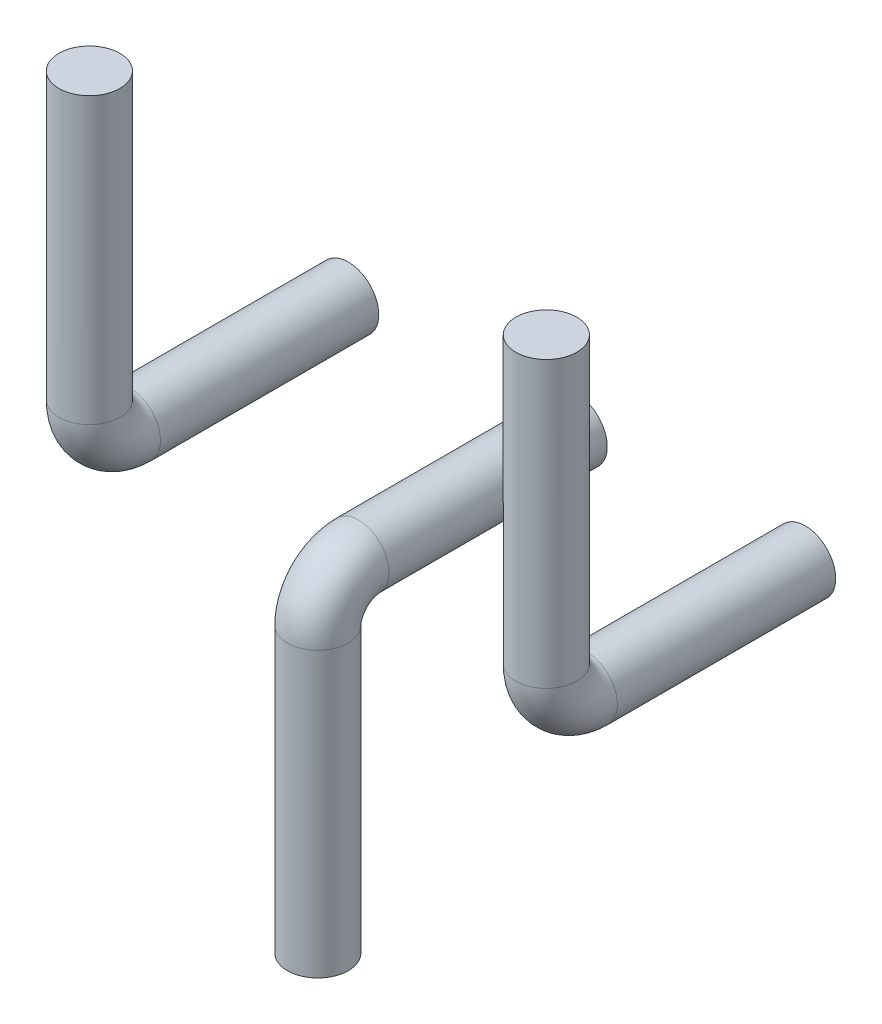
ISO-10303-21;
HEADER;
FILE_DESCRIPTION(('STEP AP214'),'2;1');
FILE_NAME('part.step','',(''),(''),'','','');
FILE_SCHEMA(('AUTOMOTIVE_DESIGN { 1 0 10303 214 1 1 1 1 }'));
ENDSEC;
DATA;
#1=APPLICATION_CONTEXT('core data for automotive mechanical design processes');
#2=APPLICATION_PROTOCOL_DEFINITION('international standard','automotive_design',2000,#1);
#3=PRODUCT_CONTEXT('',#1,'mechanical');
#4=PRODUCT('Part','Part','',(#3));
#5=PRODUCT_RELATED_PRODUCT_CATEGORY('part','',(#4));
#6=PRODUCT_DEFINITION_FORMATION('','',#4);
#7=PRODUCT_DEFINITION_CONTEXT('part definition',#1,'design');
#8=PRODUCT_DEFINITION('design','',#6,#7);
#9=PRODUCT_DEFINITION_SHAPE('','',#8);
#10=(LENGTH_UNIT() NAMED_UNIT(*) SI_UNIT(.MILLI.,.METRE.));
#11=(NAMED_UNIT(*) PLANE_ANGLE_UNIT() SI_UNIT($,.RADIAN.));
#12=(NAMED_UNIT(*) SI_UNIT($,.STERADIAN.) SOLID_ANGLE_UNIT());
#13=UNCERTAINTY_MEASURE_WITH_UNIT(LENGTH_MEASURE(1.E-05),#10,'distance_accuracy_value','');
#14=(GEOMETRIC_REPRESENTATION_CONTEXT(3) GLOBAL_UNCERTAINTY_ASSIGNED_CONTEXT((#13)) GLOBAL_UNIT_ASSIGNED_CONTEXT((#10,
#11,#12)) REPRESENTATION_CONTEXT('',''));
#15=CARTESIAN_POINT('',(0.,0.,0.));
#16=DIRECTION('',(0.,0.,1.));
#17=DIRECTION('',(1.,0.,0.));
#18=AXIS2_PLACEMENT_3D('',#15,#16,#17);
#19=CARTESIAN_POINT('',(-32.5000000000001,-32.,25.5));
#20=DIRECTION('',(0.,-1.,0.));
#21=DIRECTION('',(1.,0.,0.));
#22=AXIS2_PLACEMENT_3D('',#19,#20,#21);
#23=PLANE('',#22);
#24=CARTESIAN_POINT('',(-32.5000000000001,-32.,25.5));
#25=DIRECTION('',(0.,-1.,0.));
#26=DIRECTION('',(1.,0.,0.));
#27=AXIS2_PLACEMENT_3D('',#24,#25,#26);
#28=CIRCLE('',#27,3.);
#29=CARTESIAN_POINT('',(-29.5000000000001,-32.,25.5));
#30=VERTEX_POINT('',#29);
#31=EDGE_CURVE('E57',#30,#30,#28,.T.);
#32=ORIENTED_EDGE('',*,*,#31,.T.);
#33=EDGE_LOOP('',(#32));
#34=FACE_BOUND('',#33,.T.);
#35=ADVANCED_FACE('F43',(#34),#23,.T.);
#36=CARTESIAN_POINT('',(-32.5000000000001,-0.0508158360944468,0.));
#37=DIRECTION('',(0.,0.,1.));
#38=DIRECTION('',(1.,0.,0.));
#39=AXIS2_PLACEMENT_3D('',#36,#37,#38);
#40=PLANE('',#39);
#41=CARTESIAN_POINT('',(-32.5000000000001,-0.0508158360944468,0.));
#42=DIRECTION('',(0.,0.,1.));
#43=DIRECTION('',(1.,0.,0.));
#44=AXIS2_PLACEMENT_3D('',#41,#42,#43);
#45=CIRCLE('',#44,3.);
#46=CARTESIAN_POINT('',(-29.5000000000001,-0.0508158360944468,0.));
#47=VERTEX_POINT('',#46);
#48=EDGE_CURVE('E11',#47,#47,#45,.T.);
#49=ORIENTED_EDGE('',*,*,#48,.F.);
#50=EDGE_LOOP('',(#49));
#51=FACE_BOUND('',#50,.T.);
#52=ADVANCED_FACE('F67',(#51),#40,.F.);
#53=CARTESIAN_POINT('',(-32.5000000000001,-32.,25.5));
#54=DIRECTION('',(0.,1.,0.));
#55=DIRECTION('',(0.,0.,1.));
#56=AXIS2_PLACEMENT_3D('',#53,#54,#55);
#57=CYLINDRICAL_SURFACE('',#56,3.);
#58=CARTESIAN_POINT('',(-32.5000000000001,-4.05081583609447,25.5));
#59=DIRECTION('',(0.,-1.,0.));
#60=DIRECTION('',(1.,0.,0.));
#61=AXIS2_PLACEMENT_3D('',#58,#59,#60);
#62=CIRCLE('',#61,3.);
#63=CARTESIAN_POINT('',(-32.5000000000001,-4.0508158360945,28.5));
#64=VERTEX_POINT('',#63);
#65=EDGE_CURVE('E53',#64,#64,#62,.T.);
#66=ORIENTED_EDGE('',*,*,#65,.T.);
#67=EDGE_LOOP('',(#66));
#68=FACE_BOUND('',#67,.T.);
#69=ORIENTED_EDGE('',*,*,#31,.F.);
#70=EDGE_LOOP('',(#69));
#71=FACE_BOUND('',#70,.T.);
#72=ADVANCED_FACE('F64',(#68,#71),#57,.T.);
#73=CARTESIAN_POINT('',(-32.5000000000001,-4.05081583609445,21.5));
#74=DIRECTION('',(-1.,0.,0.));
#75=DIRECTION('',(0.,0.,1.));
#76=AXIS2_PLACEMENT_3D('',#73,#74,#75);
#77=TOROIDAL_SURFACE('',#76,4.,3.);
#78=CARTESIAN_POINT('',(-32.5000000000001,-0.0508158360944463,21.5));
#79=DIRECTION('',(0.,0.,1.));
#80=DIRECTION('',(1.,0.,0.));
#81=AXIS2_PLACEMENT_3D('',#78,#79,#80);
#82=CIRCLE('',#81,3.);
#83=CARTESIAN_POINT('',(-32.5000000000001,2.94918416390555,21.5));
#84=VERTEX_POINT('',#83);
#85=EDGE_CURVE('E49',#84,#84,#82,.T.);
#86=CARTESIAN_POINT('',(-32.5000000000001,-4.05081583609445,21.5));
#87=DIRECTION('',(-1.,0.,0.));
#88=DIRECTION('',(0.,0.,1.));
#89=AXIS2_PLACEMENT_3D('',#86,#87,#88);
#90=CIRCLE('',#89,7.);
#91=EDGE_CURVE('',#64,#84,#90,.T.);
#92=ORIENTED_EDGE('',*,*,#65,.F.);
#93=ORIENTED_EDGE('',*,*,#85,.T.);
#94=ORIENTED_EDGE('',*,*,#91,.T.);
#95=ORIENTED_EDGE('',*,*,#91,.F.);
#96=EDGE_LOOP('',(#92,#94,#93,#95));
#97=FACE_BOUND('',#96,.T.);
#98=ADVANCED_FACE('F66',(#97),#77,.T.);
#99=CARTESIAN_POINT('',(-32.5000000000001,-0.0508158360944468,21.5));
#100=DIRECTION('',(0.,0.,-1.));
#101=DIRECTION('',(-1.,0.,0.));
#102=AXIS2_PLACEMENT_3D('',#99,#100,#101);
#103=CYLINDRICAL_SURFACE('',#102,3.);
#104=ORIENTED_EDGE('',*,*,#48,.T.);
#105=EDGE_LOOP('',(#104));
#106=FACE_BOUND('',#105,.T.);
#107=ORIENTED_EDGE('',*,*,#85,.F.);
#108=EDGE_LOOP('',(#107));
#109=FACE_BOUND('',#108,.T.);
#110=ADVANCED_FACE('F74',(#106,#109),#103,.T.);
#111=CLOSED_SHELL('',(#35,#52,#72,#98,#110));
#112=MANIFOLD_SOLID_BREP('B2',#111);
#113=CARTESIAN_POINT('',(-55.0000000000002,31.9999999999999,25.5));
#114=DIRECTION('',(0.,1.,0.));
#115=DIRECTION('',(1.,0.,0.));
#116=AXIS2_PLACEMENT_3D('',#113,#114,#115);
#117=PLANE('',#116);
#118=CARTESIAN_POINT('',(-55.0000000000002,31.9999999999999,25.5));
#119=DIRECTION('',(0.,1.,0.));
#120=DIRECTION('',(1.,0.,0.));
#121=AXIS2_PLACEMENT_3D('',#118,#119,#120);
#122=CIRCLE('',#121,3.);
#123=CARTESIAN_POINT('',(-52.0000000000002,31.9999999999999,25.5));
#124=VERTEX_POINT('',#123);
#125=EDGE_CURVE('E134',#124,#124,#122,.T.);
#126=ORIENTED_EDGE('',*,*,#125,.T.);
#127=EDGE_LOOP('',(#126));
#128=FACE_BOUND('',#127,.T.);
#129=ADVANCED_FACE('F120',(#128),#117,.T.);
#130=CARTESIAN_POINT('',(-55.0000000000002,-0.0508158360944468,0.));
#131=DIRECTION('',(0.,0.,1.));
#132=DIRECTION('',(1.,0.,0.));
#133=AXIS2_PLACEMENT_3D('',#130,#131,#132);
#134=PLANE('',#133);
#135=CARTESIAN_POINT('',(-55.0000000000002,-0.0508158360944468,0.));
#136=DIRECTION('',(0.,0.,1.));
#137=DIRECTION('',(1.,0.,0.));
#138=AXIS2_PLACEMENT_3D('',#135,#136,#137);
#139=CIRCLE('',#138,3.);
#140=CARTESIAN_POINT('',(-52.0000000000002,-0.0508158360944468,0.));
#141=VERTEX_POINT('',#140);
#142=EDGE_CURVE('E42',#141,#141,#139,.T.);
#143=ORIENTED_EDGE('',*,*,#142,.F.);
#144=EDGE_LOOP('',(#143));
#145=FACE_BOUND('',#144,.T.);
#146=ADVANCED_FACE('F144',(#145),#134,.F.);
#147=CARTESIAN_POINT('',(-55.0000000000002,31.9999999999999,25.5));
#148=DIRECTION('',(0.,-1.,0.));
#149=DIRECTION('',(0.,0.,-1.));
#150=AXIS2_PLACEMENT_3D('',#147,#148,#149);
#151=CYLINDRICAL_SURFACE('',#150,3.);
#152=CARTESIAN_POINT('',(-55.0000000000002,3.94918416390558,25.5));
#153=DIRECTION('',(0.,1.,0.));
#154=DIRECTION('',(1.,0.,0.));
#155=AXIS2_PLACEMENT_3D('',#152,#153,#154);
#156=CIRCLE('',#155,3.);
#157=CARTESIAN_POINT('',(-55.0000000000002,3.9491841639056,28.5));
#158=VERTEX_POINT('',#157);
#159=EDGE_CURVE('E130',#158,#158,#156,.T.);
#160=ORIENTED_EDGE('',*,*,#159,.T.);
#161=EDGE_LOOP('',(#160));
#162=FACE_BOUND('',#161,.T.);
#163=ORIENTED_EDGE('',*,*,#125,.F.);
#164=EDGE_LOOP('',(#163));
#165=FACE_BOUND('',#164,.T.);
#166=ADVANCED_FACE('F141',(#162,#165),#151,.T.);
#167=CARTESIAN_POINT('',(-55.0000000000002,3.94918416390555,21.5));
#168=DIRECTION('',(1.,0.,0.));
#169=DIRECTION('',(0.,0.,-1.));
#170=AXIS2_PLACEMENT_3D('',#167,#168,#169);
#171=TOROIDAL_SURFACE('',#170,4.,3.);
#172=CARTESIAN_POINT('',(-55.0000000000002,-0.0508158360944472,21.5));
#173=DIRECTION('',(0.,0.,1.));
#174=DIRECTION('',(1.,0.,0.));
#175=AXIS2_PLACEMENT_3D('',#172,#173,#174);
#176=CIRCLE('',#175,3.);
#177=CARTESIAN_POINT('',(-55.0000000000002,-3.05081583609445,21.5));
#178=VERTEX_POINT('',#177);
#179=EDGE_CURVE('E126',#178,#178,#176,.T.);
#180=CARTESIAN_POINT('',(-55.0000000000002,3.94918416390555,21.5));
#181=DIRECTION('',(1.,0.,0.));
#182=DIRECTION('',(0.,0.,-1.));
#183=AXIS2_PLACEMENT_3D('',#180,#181,#182);
#184=CIRCLE('',#183,7.);
#185=EDGE_CURVE('',#158,#178,#184,.T.);
#186=ORIENTED_EDGE('',*,*,#159,.F.);
#187=ORIENTED_EDGE('',*,*,#179,.T.);
#188=ORIENTED_EDGE('',*,*,#185,.T.);
#189=ORIENTED_EDGE('',*,*,#185,.F.);
#190=EDGE_LOOP('',(#186,#188,#187,#189));
#191=FACE_BOUND('',#190,.T.);
#192=ADVANCED_FACE('F143',(#191),#171,.T.);
#193=CARTESIAN_POINT('',(-55.0000000000002,-0.0508158360944468,21.5));
#194=DIRECTION('',(0.,0.,-1.));
#195=DIRECTION('',(-1.,0.,0.));
#196=AXIS2_PLACEMENT_3D('',#193,#194,#195);
#197=CYLINDRICAL_SURFACE('',#196,3.);
#198=ORIENTED_EDGE('',*,*,#142,.T.);
#199=EDGE_LOOP('',(#198));
#200=FACE_BOUND('',#199,.T.);
#201=ORIENTED_EDGE('',*,*,#179,.F.);
#202=EDGE_LOOP('',(#201));
#203=FACE_BOUND('',#202,.T.);
#204=ADVANCED_FACE('F151',(#200,#203),#197,.T.);
#205=CLOSED_SHELL('',(#129,#146,#166,#192,#204));
#206=MANIFOLD_SOLID_BREP('B6',#205);
#207=CARTESIAN_POINT('',(-10.0000000000002,31.9999999999999,25.5));
#208=DIRECTION('',(0.,1.,0.));
#209=DIRECTION('',(1.,0.,0.));
#210=AXIS2_PLACEMENT_3D('',#207,#208,#209);
#211=PLANE('',#210);
#212=CARTESIAN_POINT('',(-10.0000000000002,31.9999999999999,25.5));
#213=DIRECTION('',(0.,1.,0.));
#214=DIRECTION('',(1.,0.,0.));
#215=AXIS2_PLACEMENT_3D('',#212,#213,#214);
#216=CIRCLE('',#215,3.);
#217=CARTESIAN_POINT('',(-7.00000000000018,31.9999999999999,25.5));
#218=VERTEX_POINT('',#217);
#219=EDGE_CURVE('E204',#218,#218,#216,.T.);
#220=ORIENTED_EDGE('',*,*,#219,.T.);
#221=EDGE_LOOP('',(#220));
#222=FACE_BOUND('',#221,.T.);
#223=ADVANCED_FACE('F190',(#222),#211,.T.);
#224=CARTESIAN_POINT('',(-10.0000000000002,-0.0508158360944468,0.));
#225=DIRECTION('',(0.,0.,1.));
#226=DIRECTION('',(1.,0.,0.));
#227=AXIS2_PLACEMENT_3D('',#224,#225,#226);
#228=PLANE('',#227);
#229=CARTESIAN_POINT('',(-10.0000000000002,-0.0508158360944468,0.));
#230=DIRECTION('',(0.,0.,1.));
#231=DIRECTION('',(1.,0.,0.));
#232=AXIS2_PLACEMENT_3D('',#229,#230,#231);
#233=CIRCLE('',#232,3.);
#234=CARTESIAN_POINT('',(-7.00000000000018,-0.0508158360944468,0.));
#235=VERTEX_POINT('',#234);
#236=EDGE_CURVE('E119',#235,#235,#233,.T.);
#237=ORIENTED_EDGE('',*,*,#236,.F.);
#238=EDGE_LOOP('',(#237));
#239=FACE_BOUND('',#238,.T.);
#240=ADVANCED_FACE('F214',(#239),#228,.F.);
#241=CARTESIAN_POINT('',(-10.0000000000002,31.9999999999999,25.5));
#242=DIRECTION('',(0.,-1.,0.));
#243=DIRECTION('',(0.,0.,-1.));
#244=AXIS2_PLACEMENT_3D('',#241,#242,#243);
#245=CYLINDRICAL_SURFACE('',#244,3.);
#246=CARTESIAN_POINT('',(-10.0000000000002,3.94918416390558,25.5));
#247=DIRECTION('',(0.,1.,0.));
#248=DIRECTION('',(1.,0.,0.));
#249=AXIS2_PLACEMENT_3D('',#246,#247,#248);
#250=CIRCLE('',#249,3.);
#251=CARTESIAN_POINT('',(-10.0000000000002,3.9491841639056,28.5));
#252=VERTEX_POINT('',#251);
#253=EDGE_CURVE('E200',#252,#252,#250,.T.);
#254=ORIENTED_EDGE('',*,*,#253,.T.);
#255=EDGE_LOOP('',(#254));
#256=FACE_BOUND('',#255,.T.);
#257=ORIENTED_EDGE('',*,*,#219,.F.);
#258=EDGE_LOOP('',(#257));
#259=FACE_BOUND('',#258,.T.);
#260=ADVANCED_FACE('F211',(#256,#259),#245,.T.);
#261=CARTESIAN_POINT('',(-10.0000000000002,3.94918416390555,21.5));
#262=DIRECTION('',(1.,0.,0.));
#263=DIRECTION('',(0.,0.,-1.));
#264=AXIS2_PLACEMENT_3D('',#261,#262,#263);
#265=TOROIDAL_SURFACE('',#264,4.,3.);
#266=CARTESIAN_POINT('',(-10.0000000000002,-0.0508158360944472,21.5));
#267=DIRECTION('',(0.,0.,1.));
#268=DIRECTION('',(1.,0.,0.));
#269=AXIS2_PLACEMENT_3D('',#266,#267,#268);
#270=CIRCLE('',#269,3.);
#271=CARTESIAN_POINT('',(-10.0000000000002,-3.05081583609445,21.5));
#272=VERTEX_POINT('',#271);
#273=EDGE_CURVE('E196',#272,#272,#270,.T.);
#274=CARTESIAN_POINT('',(-10.0000000000002,3.94918416390555,21.5));
#275=DIRECTION('',(1.,0.,0.));
#276=DIRECTION('',(0.,0.,-1.));
#277=AXIS2_PLACEMENT_3D('',#274,#275,#276);
#278=CIRCLE('',#277,7.);
#279=EDGE_CURVE('',#252,#272,#278,.T.);
#280=ORIENTED_EDGE('',*,*,#253,.F.);
#281=ORIENTED_EDGE('',*,*,#273,.T.);
#282=ORIENTED_EDGE('',*,*,#279,.T.);
#283=ORIENTED_EDGE('',*,*,#279,.F.);
#284=EDGE_LOOP('',(#280,#282,#281,#283));
#285=FACE_BOUND('',#284,.T.);
#286=ADVANCED_FACE('F213',(#285),#265,.T.);
#287=CARTESIAN_POINT('',(-10.0000000000002,-0.0508158360944468,21.5));
#288=DIRECTION('',(0.,0.,-1.));
#289=DIRECTION('',(-1.,0.,0.));
#290=AXIS2_PLACEMENT_3D('',#287,#288,#289);
#291=CYLINDRICAL_SURFACE('',#290,3.);
#292=ORIENTED_EDGE('',*,*,#236,.T.);
#293=EDGE_LOOP('',(#292));
#294=FACE_BOUND('',#293,.T.);
#295=ORIENTED_EDGE('',*,*,#273,.F.);
#296=EDGE_LOOP('',(#295));
#297=FACE_BOUND('',#296,.T.);
#298=ADVANCED_FACE('F221',(#294,#297),#291,.T.);
#299=CLOSED_SHELL('',(#223,#240,#260,#286,#298));
#300=MANIFOLD_SOLID_BREP('B37',#299);
#301=ADVANCED_BREP_SHAPE_REPRESENTATION('',(#18,#112,#206,#300),#14);
#302=SHAPE_DEFINITION_REPRESENTATION(#9,#301);
ENDSEC;
END-ISO-10303-21;
